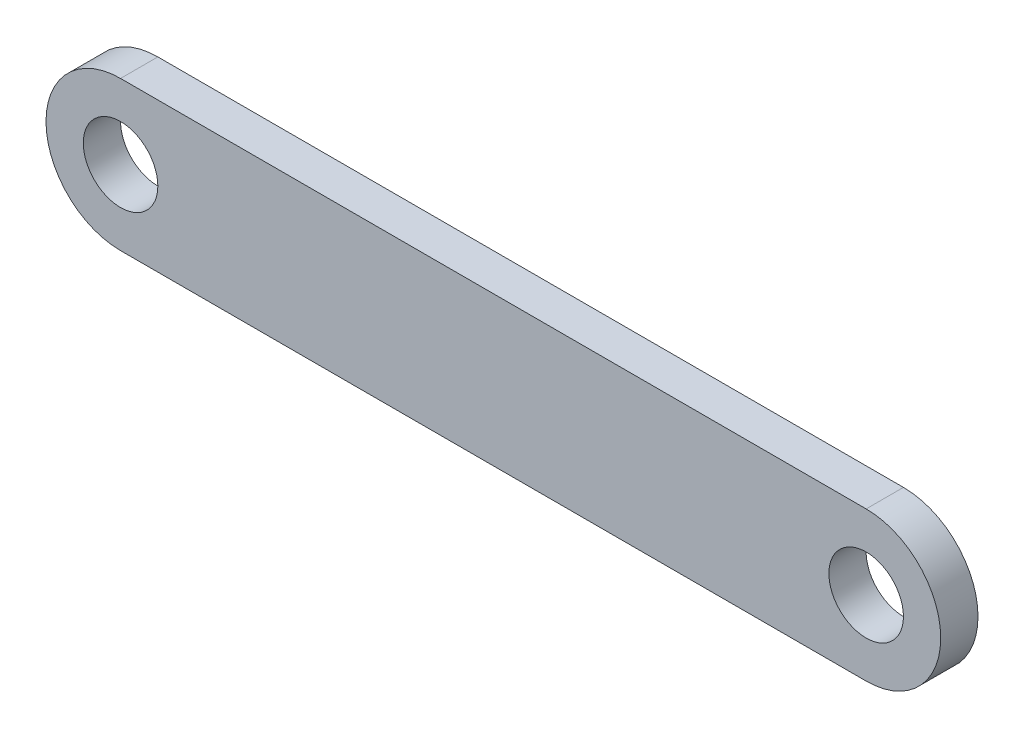
ISO-10303-21;
HEADER;
FILE_DESCRIPTION(('STEP AP214'),'2;1');
FILE_NAME('part.step','',(''),(''),'','','');
FILE_SCHEMA(('AUTOMOTIVE_DESIGN { 1 0 10303 214 1 1 1 1 }'));
ENDSEC;
DATA;
#1=APPLICATION_CONTEXT('core data for automotive mechanical design processes');
#2=APPLICATION_PROTOCOL_DEFINITION('international standard','automotive_design',2000,#1);
#3=PRODUCT_CONTEXT('',#1,'mechanical');
#4=PRODUCT('Part','Part','',(#3));
#5=PRODUCT_RELATED_PRODUCT_CATEGORY('part','',(#4));
#6=PRODUCT_DEFINITION_FORMATION('','',#4);
#7=PRODUCT_DEFINITION_CONTEXT('part definition',#1,'design');
#8=PRODUCT_DEFINITION('design','',#6,#7);
#9=PRODUCT_DEFINITION_SHAPE('','',#8);
#10=(LENGTH_UNIT() NAMED_UNIT(*) SI_UNIT(.MILLI.,.METRE.));
#11=(NAMED_UNIT(*) PLANE_ANGLE_UNIT() SI_UNIT($,.RADIAN.));
#12=(NAMED_UNIT(*) SI_UNIT($,.STERADIAN.) SOLID_ANGLE_UNIT());
#13=UNCERTAINTY_MEASURE_WITH_UNIT(LENGTH_MEASURE(1.E-05),#10,'distance_accuracy_value','');
#14=(GEOMETRIC_REPRESENTATION_CONTEXT(3) GLOBAL_UNCERTAINTY_ASSIGNED_CONTEXT((#13)) GLOBAL_UNIT_ASSIGNED_CONTEXT((#10,
#11,#12)) REPRESENTATION_CONTEXT('',''));
#15=CARTESIAN_POINT('',(0.,0.,0.));
#16=DIRECTION('',(0.,0.,1.));
#17=DIRECTION('',(1.,0.,0.));
#18=AXIS2_PLACEMENT_3D('',#15,#16,#17);
#19=CARTESIAN_POINT('',(0.,0.,5.));
#20=DIRECTION('',(0.,0.,1.));
#21=DIRECTION('',(1.,0.,0.));
#22=AXIS2_PLACEMENT_3D('',#19,#20,#21);
#23=PLANE('',#22);
#24=CARTESIAN_POINT('',(0.,0.,5.));
#25=DIRECTION('',(0.,0.,1.));
#26=DIRECTION('',(1.,0.,0.));
#27=AXIS2_PLACEMENT_3D('',#24,#25,#26);
#28=CIRCLE('',#27,5.);
#29=CARTESIAN_POINT('',(5.,0.,5.));
#30=VERTEX_POINT('',#29);
#31=EDGE_CURVE('E103',#30,#30,#28,.T.);
#32=ORIENTED_EDGE('',*,*,#31,.F.);
#33=EDGE_LOOP('',(#32));
#34=FACE_BOUND('',#33,.T.);
#35=CARTESIAN_POINT('',(0.,0.,5.));
#36=DIRECTION('',(0.,0.,1.));
#37=DIRECTION('',(1.,0.,0.));
#38=AXIS2_PLACEMENT_3D('',#35,#36,#37);
#39=CIRCLE('',#38,10.);
#40=CARTESIAN_POINT('',(0.,10.,5.));
#41=VERTEX_POINT('',#40);
#42=CARTESIAN_POINT('',(0.,-10.,5.));
#43=VERTEX_POINT('',#42);
#44=EDGE_CURVE('E88',#41,#43,#39,.T.);
#45=ORIENTED_EDGE('',*,*,#44,.T.);
#46=DIRECTION('',(1.,0.,0.));
#47=VECTOR('',#46,1.);
#48=CARTESIAN_POINT('',(0.,-10.,5.));
#49=LINE('',#48,#47);
#50=CARTESIAN_POINT('',(100.,-10.,5.));
#51=VERTEX_POINT('',#50);
#52=EDGE_CURVE('E83',#43,#51,#49,.T.);
#53=ORIENTED_EDGE('',*,*,#52,.T.);
#54=CARTESIAN_POINT('',(100.,0.,5.));
#55=DIRECTION('',(0.,0.,1.));
#56=DIRECTION('',(1.,0.,0.));
#57=AXIS2_PLACEMENT_3D('',#54,#55,#56);
#58=CIRCLE('',#57,10.);
#59=CARTESIAN_POINT('',(100.,10.,5.));
#60=VERTEX_POINT('',#59);
#61=EDGE_CURVE('E86',#51,#60,#58,.T.);
#62=ORIENTED_EDGE('',*,*,#61,.T.);
#63=DIRECTION('',(-1.,0.,0.));
#64=VECTOR('',#63,1.);
#65=CARTESIAN_POINT('',(0.,10.,5.));
#66=LINE('',#65,#64);
#67=EDGE_CURVE('E53',#60,#41,#66,.T.);
#68=ORIENTED_EDGE('',*,*,#67,.T.);
#69=EDGE_LOOP('',(#45,#53,#62,#68));
#70=FACE_BOUND('',#69,.T.);
#71=CARTESIAN_POINT('',(100.,0.,5.));
#72=DIRECTION('',(0.,0.,1.));
#73=DIRECTION('',(1.,0.,0.));
#74=AXIS2_PLACEMENT_3D('',#71,#72,#73);
#75=CIRCLE('',#74,5.);
#76=CARTESIAN_POINT('',(105.,0.,5.));
#77=VERTEX_POINT('',#76);
#78=EDGE_CURVE('E118',#77,#77,#75,.T.);
#79=ORIENTED_EDGE('',*,*,#78,.F.);
#80=EDGE_LOOP('',(#79));
#81=FACE_BOUND('',#80,.T.);
#82=ADVANCED_FACE('F36',(#34,#70,#81),#23,.T.);
#83=CARTESIAN_POINT('',(0.,0.,0.));
#84=DIRECTION('',(0.,0.,1.));
#85=DIRECTION('',(1.,0.,0.));
#86=AXIS2_PLACEMENT_3D('',#83,#84,#85);
#87=PLANE('',#86);
#88=CARTESIAN_POINT('',(0.,0.,0.));
#89=DIRECTION('',(0.,0.,1.));
#90=DIRECTION('',(1.,0.,0.));
#91=AXIS2_PLACEMENT_3D('',#88,#89,#90);
#92=CIRCLE('',#91,10.);
#93=CARTESIAN_POINT('',(0.,10.,0.));
#94=VERTEX_POINT('',#93);
#95=CARTESIAN_POINT('',(0.,-10.,0.));
#96=VERTEX_POINT('',#95);
#97=EDGE_CURVE('E100',#94,#96,#92,.T.);
#98=ORIENTED_EDGE('',*,*,#97,.F.);
#99=DIRECTION('',(-1.,0.,0.));
#100=VECTOR('',#99,1.);
#101=CARTESIAN_POINT('',(0.,10.,0.));
#102=LINE('',#101,#100);
#103=CARTESIAN_POINT('',(100.,10.,0.));
#104=VERTEX_POINT('',#103);
#105=EDGE_CURVE('E76',#104,#94,#102,.T.);
#106=ORIENTED_EDGE('',*,*,#105,.F.);
#107=CARTESIAN_POINT('',(100.,0.,0.));
#108=DIRECTION('',(0.,0.,1.));
#109=DIRECTION('',(1.,0.,0.));
#110=AXIS2_PLACEMENT_3D('',#107,#108,#109);
#111=CIRCLE('',#110,10.);
#112=CARTESIAN_POINT('',(100.,-10.,0.));
#113=VERTEX_POINT('',#112);
#114=EDGE_CURVE('E70',#113,#104,#111,.T.);
#115=ORIENTED_EDGE('',*,*,#114,.F.);
#116=DIRECTION('',(1.,0.,0.));
#117=VECTOR('',#116,1.);
#118=CARTESIAN_POINT('',(0.,-10.,0.));
#119=LINE('',#118,#117);
#120=EDGE_CURVE('E92',#96,#113,#119,.T.);
#121=ORIENTED_EDGE('',*,*,#120,.F.);
#122=EDGE_LOOP('',(#98,#106,#115,#121));
#123=FACE_BOUND('',#122,.T.);
#124=CARTESIAN_POINT('',(0.,0.,0.));
#125=DIRECTION('',(0.,0.,1.));
#126=DIRECTION('',(1.,0.,0.));
#127=AXIS2_PLACEMENT_3D('',#124,#125,#126);
#128=CIRCLE('',#127,5.);
#129=CARTESIAN_POINT('',(5.,0.,0.));
#130=VERTEX_POINT('',#129);
#131=EDGE_CURVE('E115',#130,#130,#128,.T.);
#132=ORIENTED_EDGE('',*,*,#131,.T.);
#133=EDGE_LOOP('',(#132));
#134=FACE_BOUND('',#133,.T.);
#135=CARTESIAN_POINT('',(100.,0.,0.));
#136=DIRECTION('',(0.,0.,1.));
#137=DIRECTION('',(1.,0.,0.));
#138=AXIS2_PLACEMENT_3D('',#135,#136,#137);
#139=CIRCLE('',#138,5.);
#140=CARTESIAN_POINT('',(105.,0.,0.));
#141=VERTEX_POINT('',#140);
#142=EDGE_CURVE('E121',#141,#141,#139,.T.);
#143=ORIENTED_EDGE('',*,*,#142,.T.);
#144=EDGE_LOOP('',(#143));
#145=FACE_BOUND('',#144,.T.);
#146=ADVANCED_FACE('F111',(#123,#134,#145),#87,.F.);
#147=CARTESIAN_POINT('',(0.,0.,5.));
#148=DIRECTION('',(0.,0.,-1.));
#149=DIRECTION('',(-1.,0.,0.));
#150=AXIS2_PLACEMENT_3D('',#147,#148,#149);
#151=CYLINDRICAL_SURFACE('',#150,10.);
#152=ORIENTED_EDGE('',*,*,#97,.T.);
#153=DIRECTION('',(0.,0.,-1.));
#154=VECTOR('',#153,1.);
#155=CARTESIAN_POINT('',(0.,-10.,5.));
#156=LINE('',#155,#154);
#157=EDGE_CURVE('E11',#43,#96,#156,.T.);
#158=ORIENTED_EDGE('',*,*,#157,.F.);
#159=ORIENTED_EDGE('',*,*,#44,.F.);
#160=DIRECTION('',(0.,0.,-1.));
#161=VECTOR('',#160,1.);
#162=CARTESIAN_POINT('',(0.,10.,5.));
#163=LINE('',#162,#161);
#164=EDGE_CURVE('E96',#41,#94,#163,.T.);
#165=ORIENTED_EDGE('',*,*,#164,.T.);
#166=EDGE_LOOP('',(#152,#158,#159,#165));
#167=FACE_BOUND('',#166,.T.);
#168=ADVANCED_FACE('F38',(#167),#151,.T.);
#169=CARTESIAN_POINT('',(0.,-10.,5.));
#170=DIRECTION('',(0.,1.,0.));
#171=DIRECTION('',(0.,0.,1.));
#172=AXIS2_PLACEMENT_3D('',#169,#170,#171);
#173=PLANE('',#172);
#174=ORIENTED_EDGE('',*,*,#120,.T.);
#175=DIRECTION('',(0.,0.,-1.));
#176=VECTOR('',#175,1.);
#177=CARTESIAN_POINT('',(100.,-10.,5.));
#178=LINE('',#177,#176);
#179=EDGE_CURVE('E45',#51,#113,#178,.T.);
#180=ORIENTED_EDGE('',*,*,#179,.F.);
#181=ORIENTED_EDGE('',*,*,#52,.F.);
#182=ORIENTED_EDGE('',*,*,#157,.T.);
#183=EDGE_LOOP('',(#174,#180,#181,#182));
#184=FACE_BOUND('',#183,.T.);
#185=ADVANCED_FACE('F91',(#184),#173,.F.);
#186=CARTESIAN_POINT('',(100.,0.,5.));
#187=DIRECTION('',(0.,0.,-1.));
#188=DIRECTION('',(-1.,0.,0.));
#189=AXIS2_PLACEMENT_3D('',#186,#187,#188);
#190=CYLINDRICAL_SURFACE('',#189,10.);
#191=ORIENTED_EDGE('',*,*,#114,.T.);
#192=DIRECTION('',(0.,0.,-1.));
#193=VECTOR('',#192,1.);
#194=CARTESIAN_POINT('',(100.,10.,5.));
#195=LINE('',#194,#193);
#196=EDGE_CURVE('E93',#60,#104,#195,.T.);
#197=ORIENTED_EDGE('',*,*,#196,.F.);
#198=ORIENTED_EDGE('',*,*,#61,.F.);
#199=ORIENTED_EDGE('',*,*,#179,.T.);
#200=EDGE_LOOP('',(#191,#197,#198,#199));
#201=FACE_BOUND('',#200,.T.);
#202=ADVANCED_FACE('F94',(#201),#190,.T.);
#203=CARTESIAN_POINT('',(0.,10.,5.));
#204=DIRECTION('',(0.,-1.,0.));
#205=DIRECTION('',(0.,0.,-1.));
#206=AXIS2_PLACEMENT_3D('',#203,#204,#205);
#207=PLANE('',#206);
#208=ORIENTED_EDGE('',*,*,#105,.T.);
#209=ORIENTED_EDGE('',*,*,#164,.F.);
#210=ORIENTED_EDGE('',*,*,#67,.F.);
#211=ORIENTED_EDGE('',*,*,#196,.T.);
#212=EDGE_LOOP('',(#208,#209,#210,#211));
#213=FACE_BOUND('',#212,.T.);
#214=ADVANCED_FACE('F108',(#213),#207,.F.);
#215=CARTESIAN_POINT('',(0.,0.,5.));
#216=DIRECTION('',(0.,0.,-1.));
#217=DIRECTION('',(-1.,0.,0.));
#218=AXIS2_PLACEMENT_3D('',#215,#216,#217);
#219=CYLINDRICAL_SURFACE('',#218,5.);
#220=ORIENTED_EDGE('',*,*,#31,.T.);
#221=EDGE_LOOP('',(#220));
#222=FACE_BOUND('',#221,.T.);
#223=ORIENTED_EDGE('',*,*,#131,.F.);
#224=EDGE_LOOP('',(#223));
#225=FACE_BOUND('',#224,.T.);
#226=ADVANCED_FACE('F138',(#222,#225),#219,.F.);
#227=CARTESIAN_POINT('',(100.,0.,5.));
#228=DIRECTION('',(0.,0.,-1.));
#229=DIRECTION('',(-1.,0.,0.));
#230=AXIS2_PLACEMENT_3D('',#227,#228,#229);
#231=CYLINDRICAL_SURFACE('',#230,5.);
#232=ORIENTED_EDGE('',*,*,#78,.T.);
#233=EDGE_LOOP('',(#232));
#234=FACE_BOUND('',#233,.T.);
#235=ORIENTED_EDGE('',*,*,#142,.F.);
#236=EDGE_LOOP('',(#235));
#237=FACE_BOUND('',#236,.T.);
#238=ADVANCED_FACE('F127',(#234,#237),#231,.F.);
#239=CLOSED_SHELL('',(#82,#146,#168,#185,#202,#214,#226,#238));
#240=MANIFOLD_SOLID_BREP('B2',#239);
#241=ADVANCED_BREP_SHAPE_REPRESENTATION('',(#18,#240),#14);
#242=SHAPE_DEFINITION_REPRESENTATION(#9,#241);
ENDSEC;
END-ISO-10303-21;
